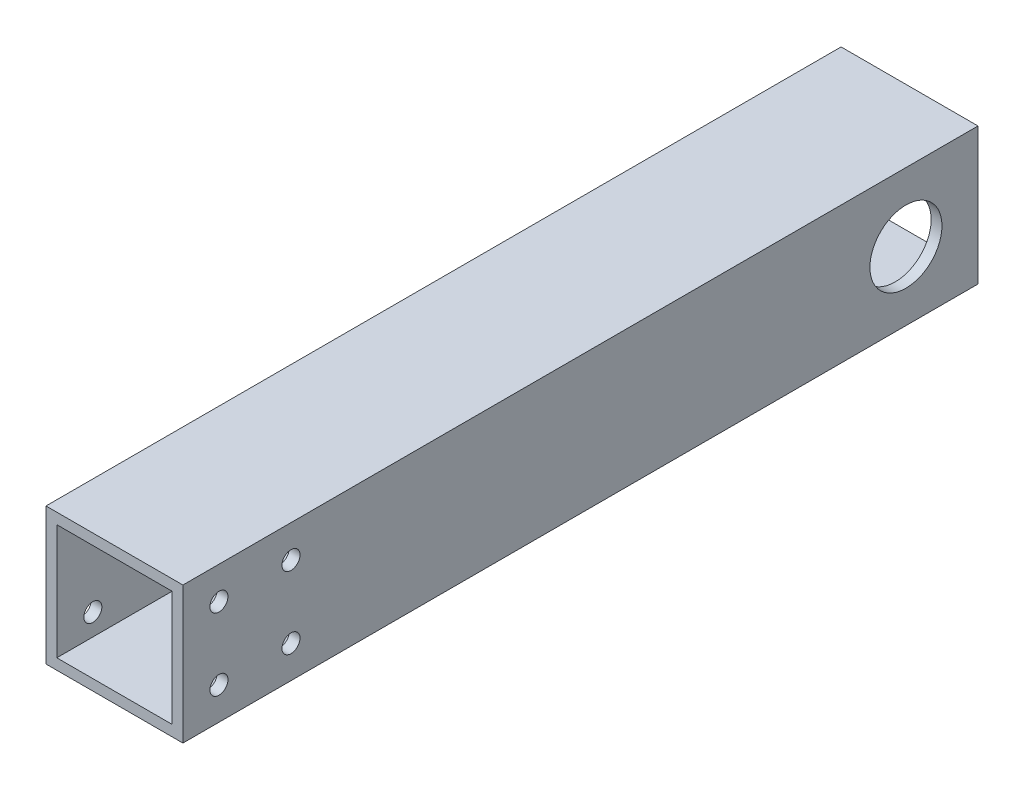
ISO-10303-21;
HEADER;
FILE_DESCRIPTION(('STEP AP214'),'2;1');
FILE_NAME('part.step','',(''),(''),'','','');
FILE_SCHEMA(('AUTOMOTIVE_DESIGN { 1 0 10303 214 1 1 1 1 }'));
ENDSEC;
DATA;
#1=APPLICATION_CONTEXT('core data for automotive mechanical design processes');
#2=APPLICATION_PROTOCOL_DEFINITION('international standard','automotive_design',2000,#1);
#3=PRODUCT_CONTEXT('',#1,'mechanical');
#4=PRODUCT('Part','Part','',(#3));
#5=PRODUCT_RELATED_PRODUCT_CATEGORY('part','',(#4));
#6=PRODUCT_DEFINITION_FORMATION('','',#4);
#7=PRODUCT_DEFINITION_CONTEXT('part definition',#1,'design');
#8=PRODUCT_DEFINITION('design','',#6,#7);
#9=PRODUCT_DEFINITION_SHAPE('','',#8);
#10=(LENGTH_UNIT() NAMED_UNIT(*) SI_UNIT(.MILLI.,.METRE.));
#11=(NAMED_UNIT(*) PLANE_ANGLE_UNIT() SI_UNIT($,.RADIAN.));
#12=(NAMED_UNIT(*) SI_UNIT($,.STERADIAN.) SOLID_ANGLE_UNIT());
#13=UNCERTAINTY_MEASURE_WITH_UNIT(LENGTH_MEASURE(1.E-05),#10,'distance_accuracy_value','');
#14=(GEOMETRIC_REPRESENTATION_CONTEXT(3) GLOBAL_UNCERTAINTY_ASSIGNED_CONTEXT((#13)) GLOBAL_UNIT_ASSIGNED_CONTEXT((#10,
#11,#12)) REPRESENTATION_CONTEXT('',''));
#15=CARTESIAN_POINT('',(0.,0.,0.));
#16=DIRECTION('',(0.,0.,1.));
#17=DIRECTION('',(1.,0.,0.));
#18=AXIS2_PLACEMENT_3D('',#15,#16,#17);
#19=CARTESIAN_POINT('',(0.,0.,220.68));
#20=DIRECTION('',(0.,0.,1.));
#21=DIRECTION('',(1.,0.,0.));
#22=AXIS2_PLACEMENT_3D('',#19,#20,#21);
#23=PLANE('',#22);
#24=DIRECTION('',(0.,-1.,0.));
#25=VECTOR('',#24,1.);
#26=CARTESIAN_POINT('',(-19.,-19.,220.68));
#27=LINE('',#26,#25);
#28=CARTESIAN_POINT('',(-19.,19.,220.68));
#29=VERTEX_POINT('',#28);
#30=CARTESIAN_POINT('',(-19.,-19.,220.68));
#31=VERTEX_POINT('',#30);
#32=EDGE_CURVE('E148',#29,#31,#27,.T.);
#33=ORIENTED_EDGE('',*,*,#32,.T.);
#34=DIRECTION('',(1.,0.,0.));
#35=VECTOR('',#34,1.);
#36=CARTESIAN_POINT('',(19.,-19.,220.68));
#37=LINE('',#36,#35);
#38=CARTESIAN_POINT('',(19.,-19.,220.68));
#39=VERTEX_POINT('',#38);
#40=EDGE_CURVE('E151',#31,#39,#37,.T.);
#41=ORIENTED_EDGE('',*,*,#40,.T.);
#42=DIRECTION('',(0.,1.,0.));
#43=VECTOR('',#42,1.);
#44=CARTESIAN_POINT('',(19.,-19.,220.68));
#45=LINE('',#44,#43);
#46=CARTESIAN_POINT('',(19.,19.,220.68));
#47=VERTEX_POINT('',#46);
#48=EDGE_CURVE('E154',#39,#47,#45,.T.);
#49=ORIENTED_EDGE('',*,*,#48,.T.);
#50=DIRECTION('',(-1.,0.,0.));
#51=VECTOR('',#50,1.);
#52=CARTESIAN_POINT('',(19.,19.,220.68));
#53=LINE('',#52,#51);
#54=EDGE_CURVE('E156',#47,#29,#53,.T.);
#55=ORIENTED_EDGE('',*,*,#54,.T.);
#56=EDGE_LOOP('',(#33,#41,#49,#55));
#57=FACE_BOUND('',#56,.T.);
#58=DIRECTION('',(-1.,0.,0.));
#59=VECTOR('',#58,1.);
#60=CARTESIAN_POINT('',(16.,16.,220.68));
#61=LINE('',#60,#59);
#62=CARTESIAN_POINT('',(16.,16.,220.68));
#63=VERTEX_POINT('',#62);
#64=CARTESIAN_POINT('',(-16.,16.,220.68));
#65=VERTEX_POINT('',#64);
#66=EDGE_CURVE('E118',#63,#65,#61,.T.);
#67=ORIENTED_EDGE('',*,*,#66,.F.);
#68=DIRECTION('',(0.,1.,0.));
#69=VECTOR('',#68,1.);
#70=CARTESIAN_POINT('',(16.,-16.,220.68));
#71=LINE('',#70,#69);
#72=CARTESIAN_POINT('',(16.,-16.,220.68));
#73=VERTEX_POINT('',#72);
#74=EDGE_CURVE('E110',#73,#63,#71,.T.);
#75=ORIENTED_EDGE('',*,*,#74,.F.);
#76=DIRECTION('',(1.,0.,0.));
#77=VECTOR('',#76,1.);
#78=CARTESIAN_POINT('',(16.,-16.,220.68));
#79=LINE('',#78,#77);
#80=CARTESIAN_POINT('',(-16.,-16.,220.68));
#81=VERTEX_POINT('',#80);
#82=EDGE_CURVE('E132',#81,#73,#79,.T.);
#83=ORIENTED_EDGE('',*,*,#82,.F.);
#84=DIRECTION('',(0.,-1.,0.));
#85=VECTOR('',#84,1.);
#86=CARTESIAN_POINT('',(-16.,-16.,220.68));
#87=LINE('',#86,#85);
#88=EDGE_CURVE('E130',#65,#81,#87,.T.);
#89=ORIENTED_EDGE('',*,*,#88,.F.);
#90=EDGE_LOOP('',(#67,#75,#83,#89));
#91=FACE_BOUND('',#90,.T.);
#92=ADVANCED_FACE('F43',(#57,#91),#23,.T.);
#93=CARTESIAN_POINT('',(0.,0.,0.));
#94=DIRECTION('',(0.,0.,1.));
#95=DIRECTION('',(1.,0.,0.));
#96=AXIS2_PLACEMENT_3D('',#93,#94,#95);
#97=PLANE('',#96);
#98=DIRECTION('',(0.,-1.,0.));
#99=VECTOR('',#98,1.);
#100=CARTESIAN_POINT('',(-19.,-19.,0.));
#101=LINE('',#100,#99);
#102=CARTESIAN_POINT('',(-19.,19.,0.));
#103=VERTEX_POINT('',#102);
#104=CARTESIAN_POINT('',(-19.,-19.,0.));
#105=VERTEX_POINT('',#104);
#106=EDGE_CURVE('E126',#103,#105,#101,.T.);
#107=ORIENTED_EDGE('',*,*,#106,.F.);
#108=DIRECTION('',(-1.,0.,0.));
#109=VECTOR('',#108,1.);
#110=CARTESIAN_POINT('',(19.,19.,0.));
#111=LINE('',#110,#109);
#112=CARTESIAN_POINT('',(19.,19.,0.));
#113=VERTEX_POINT('',#112);
#114=EDGE_CURVE('E152',#113,#103,#111,.T.);
#115=ORIENTED_EDGE('',*,*,#114,.F.);
#116=DIRECTION('',(0.,1.,0.));
#117=VECTOR('',#116,1.);
#118=CARTESIAN_POINT('',(19.,-19.,0.));
#119=LINE('',#118,#117);
#120=CARTESIAN_POINT('',(19.,-19.,0.));
#121=VERTEX_POINT('',#120);
#122=EDGE_CURVE('E163',#121,#113,#119,.T.);
#123=ORIENTED_EDGE('',*,*,#122,.F.);
#124=DIRECTION('',(1.,0.,0.));
#125=VECTOR('',#124,1.);
#126=CARTESIAN_POINT('',(19.,-19.,0.));
#127=LINE('',#126,#125);
#128=EDGE_CURVE('E161',#105,#121,#127,.T.);
#129=ORIENTED_EDGE('',*,*,#128,.F.);
#130=EDGE_LOOP('',(#107,#115,#123,#129));
#131=FACE_BOUND('',#130,.T.);
#132=DIRECTION('',(0.,1.,0.));
#133=VECTOR('',#132,1.);
#134=CARTESIAN_POINT('',(16.,-16.,0.));
#135=LINE('',#134,#133);
#136=CARTESIAN_POINT('',(16.,-16.,0.));
#137=VERTEX_POINT('',#136);
#138=CARTESIAN_POINT('',(16.,16.,0.));
#139=VERTEX_POINT('',#138);
#140=EDGE_CURVE('E68',#137,#139,#135,.T.);
#141=ORIENTED_EDGE('',*,*,#140,.T.);
#142=DIRECTION('',(-1.,0.,0.));
#143=VECTOR('',#142,1.);
#144=CARTESIAN_POINT('',(16.,16.,0.));
#145=LINE('',#144,#143);
#146=CARTESIAN_POINT('',(-16.,16.,0.));
#147=VERTEX_POINT('',#146);
#148=EDGE_CURVE('E125',#139,#147,#145,.T.);
#149=ORIENTED_EDGE('',*,*,#148,.T.);
#150=DIRECTION('',(0.,-1.,0.));
#151=VECTOR('',#150,1.);
#152=CARTESIAN_POINT('',(-16.,-16.,0.));
#153=LINE('',#152,#151);
#154=CARTESIAN_POINT('',(-16.,-16.,0.));
#155=VERTEX_POINT('',#154);
#156=EDGE_CURVE('E140',#147,#155,#153,.T.);
#157=ORIENTED_EDGE('',*,*,#156,.T.);
#158=DIRECTION('',(1.,0.,0.));
#159=VECTOR('',#158,1.);
#160=CARTESIAN_POINT('',(16.,-16.,0.));
#161=LINE('',#160,#159);
#162=EDGE_CURVE('E119',#155,#137,#161,.T.);
#163=ORIENTED_EDGE('',*,*,#162,.T.);
#164=EDGE_LOOP('',(#141,#149,#157,#163));
#165=FACE_BOUND('',#164,.T.);
#166=ADVANCED_FACE('F230',(#131,#165),#97,.F.);
#167=CARTESIAN_POINT('',(-19.,-19.,220.68));
#168=DIRECTION('',(1.,0.,0.));
#169=DIRECTION('',(0.,0.,-1.));
#170=AXIS2_PLACEMENT_3D('',#167,#168,#169);
#171=PLANE('',#170);
#172=CARTESIAN_POINT('',(-19.,0.,20.));
#173=DIRECTION('',(1.,0.,0.));
#174=DIRECTION('',(0.,0.,-1.));
#175=AXIS2_PLACEMENT_3D('',#172,#173,#174);
#176=CIRCLE('',#175,10.);
#177=CARTESIAN_POINT('',(-19.,0.,10.));
#178=VERTEX_POINT('',#177);
#179=EDGE_CURVE('E311',#178,#178,#176,.T.);
#180=ORIENTED_EDGE('',*,*,#179,.T.);
#181=EDGE_LOOP('',(#180));
#182=FACE_BOUND('',#181,.T.);
#183=CARTESIAN_POINT('',(-19.,-10.,210.68));
#184=DIRECTION('',(1.,0.,0.));
#185=DIRECTION('',(0.,0.,-1.));
#186=AXIS2_PLACEMENT_3D('',#183,#184,#185);
#187=CIRCLE('',#186,2.49999999999997);
#188=CARTESIAN_POINT('',(-19.,-10.,208.18));
#189=VERTEX_POINT('',#188);
#190=EDGE_CURVE('E194',#189,#189,#187,.T.);
#191=ORIENTED_EDGE('',*,*,#190,.T.);
#192=EDGE_LOOP('',(#191));
#193=FACE_BOUND('',#192,.T.);
#194=CARTESIAN_POINT('',(-19.,10.,190.68));
#195=DIRECTION('',(1.,0.,0.));
#196=DIRECTION('',(0.,0.,-1.));
#197=AXIS2_PLACEMENT_3D('',#194,#195,#196);
#198=CIRCLE('',#197,2.50000000000002);
#199=CARTESIAN_POINT('',(-19.,10.,188.18));
#200=VERTEX_POINT('',#199);
#201=EDGE_CURVE('E190',#200,#200,#198,.T.);
#202=ORIENTED_EDGE('',*,*,#201,.T.);
#203=EDGE_LOOP('',(#202));
#204=FACE_BOUND('',#203,.T.);
#205=CARTESIAN_POINT('',(-19.,10.,210.68));
#206=DIRECTION('',(1.,0.,0.));
#207=DIRECTION('',(0.,0.,-1.));
#208=AXIS2_PLACEMENT_3D('',#205,#206,#207);
#209=CIRCLE('',#208,2.49999999999997);
#210=CARTESIAN_POINT('',(-19.,10.,208.18));
#211=VERTEX_POINT('',#210);
#212=EDGE_CURVE('E186',#211,#211,#209,.T.);
#213=ORIENTED_EDGE('',*,*,#212,.T.);
#214=EDGE_LOOP('',(#213));
#215=FACE_BOUND('',#214,.T.);
#216=CARTESIAN_POINT('',(-19.,-10.,190.68));
#217=DIRECTION('',(1.,0.,0.));
#218=DIRECTION('',(0.,0.,-1.));
#219=AXIS2_PLACEMENT_3D('',#216,#217,#218);
#220=CIRCLE('',#219,2.50000000000002);
#221=CARTESIAN_POINT('',(-19.,-10.,188.18));
#222=VERTEX_POINT('',#221);
#223=EDGE_CURVE('E138',#222,#222,#220,.T.);
#224=ORIENTED_EDGE('',*,*,#223,.T.);
#225=EDGE_LOOP('',(#224));
#226=FACE_BOUND('',#225,.T.);
#227=ORIENTED_EDGE('',*,*,#106,.T.);
#228=DIRECTION('',(0.,0.,-1.));
#229=VECTOR('',#228,1.);
#230=CARTESIAN_POINT('',(-19.,-19.,220.68));
#231=LINE('',#230,#229);
#232=EDGE_CURVE('E11',#31,#105,#231,.T.);
#233=ORIENTED_EDGE('',*,*,#232,.F.);
#234=ORIENTED_EDGE('',*,*,#32,.F.);
#235=DIRECTION('',(0.,0.,-1.));
#236=VECTOR('',#235,1.);
#237=CARTESIAN_POINT('',(-19.,19.,220.68));
#238=LINE('',#237,#236);
#239=EDGE_CURVE('E158',#29,#103,#238,.T.);
#240=ORIENTED_EDGE('',*,*,#239,.T.);
#241=EDGE_LOOP('',(#227,#233,#234,#240));
#242=FACE_BOUND('',#241,.T.);
#243=ADVANCED_FACE('F45',(#182,#193,#204,#215,#226,#242),#171,.F.);
#244=CARTESIAN_POINT('',(19.,-19.,220.68));
#245=DIRECTION('',(0.,1.,0.));
#246=DIRECTION('',(-1.,0.,0.));
#247=AXIS2_PLACEMENT_3D('',#244,#245,#246);
#248=PLANE('',#247);
#249=ORIENTED_EDGE('',*,*,#128,.T.);
#250=DIRECTION('',(0.,0.,-1.));
#251=VECTOR('',#250,1.);
#252=CARTESIAN_POINT('',(19.,-19.,220.68));
#253=LINE('',#252,#251);
#254=EDGE_CURVE('E52',#39,#121,#253,.T.);
#255=ORIENTED_EDGE('',*,*,#254,.F.);
#256=ORIENTED_EDGE('',*,*,#40,.F.);
#257=ORIENTED_EDGE('',*,*,#232,.T.);
#258=EDGE_LOOP('',(#249,#255,#256,#257));
#259=FACE_BOUND('',#258,.T.);
#260=ADVANCED_FACE('F247',(#259),#248,.F.);
#261=CARTESIAN_POINT('',(19.,-19.,220.68));
#262=DIRECTION('',(-1.,0.,0.));
#263=DIRECTION('',(0.,0.,1.));
#264=AXIS2_PLACEMENT_3D('',#261,#262,#263);
#265=PLANE('',#264);
#266=CARTESIAN_POINT('',(19.,0.,20.));
#267=DIRECTION('',(1.,0.,0.));
#268=DIRECTION('',(0.,0.,-1.));
#269=AXIS2_PLACEMENT_3D('',#266,#267,#268);
#270=CIRCLE('',#269,10.);
#271=CARTESIAN_POINT('',(19.,0.,10.));
#272=VERTEX_POINT('',#271);
#273=EDGE_CURVE('E308',#272,#272,#270,.T.);
#274=ORIENTED_EDGE('',*,*,#273,.F.);
#275=EDGE_LOOP('',(#274));
#276=FACE_BOUND('',#275,.T.);
#277=CARTESIAN_POINT('',(19.,-10.,210.68));
#278=DIRECTION('',(-1.,0.,0.));
#279=DIRECTION('',(0.,0.,-1.));
#280=AXIS2_PLACEMENT_3D('',#277,#278,#279);
#281=CIRCLE('',#280,2.49999999999997);
#282=CARTESIAN_POINT('',(19.,-10.,208.18));
#283=VERTEX_POINT('',#282);
#284=EDGE_CURVE('E182',#283,#283,#281,.T.);
#285=ORIENTED_EDGE('',*,*,#284,.T.);
#286=EDGE_LOOP('',(#285));
#287=FACE_BOUND('',#286,.T.);
#288=CARTESIAN_POINT('',(19.,10.,190.68));
#289=DIRECTION('',(-1.,0.,0.));
#290=DIRECTION('',(0.,0.,-1.));
#291=AXIS2_PLACEMENT_3D('',#288,#289,#290);
#292=CIRCLE('',#291,2.50000000000002);
#293=CARTESIAN_POINT('',(19.,10.,188.18));
#294=VERTEX_POINT('',#293);
#295=EDGE_CURVE('E300',#294,#294,#292,.T.);
#296=ORIENTED_EDGE('',*,*,#295,.T.);
#297=EDGE_LOOP('',(#296));
#298=FACE_BOUND('',#297,.T.);
#299=CARTESIAN_POINT('',(19.,10.,210.68));
#300=DIRECTION('',(-1.,0.,0.));
#301=DIRECTION('',(0.,0.,-1.));
#302=AXIS2_PLACEMENT_3D('',#299,#300,#301);
#303=CIRCLE('',#302,2.49999999999997);
#304=CARTESIAN_POINT('',(19.,10.,208.18));
#305=VERTEX_POINT('',#304);
#306=EDGE_CURVE('E297',#305,#305,#303,.T.);
#307=ORIENTED_EDGE('',*,*,#306,.T.);
#308=EDGE_LOOP('',(#307));
#309=FACE_BOUND('',#308,.T.);
#310=CARTESIAN_POINT('',(19.,-10.,190.68));
#311=DIRECTION('',(-1.,0.,0.));
#312=DIRECTION('',(0.,0.,-1.));
#313=AXIS2_PLACEMENT_3D('',#310,#311,#312);
#314=CIRCLE('',#313,2.50000000000002);
#315=CARTESIAN_POINT('',(19.,-10.,188.18));
#316=VERTEX_POINT('',#315);
#317=EDGE_CURVE('E177',#316,#316,#314,.T.);
#318=ORIENTED_EDGE('',*,*,#317,.T.);
#319=EDGE_LOOP('',(#318));
#320=FACE_BOUND('',#319,.T.);
#321=ORIENTED_EDGE('',*,*,#122,.T.);
#322=DIRECTION('',(0.,0.,-1.));
#323=VECTOR('',#322,1.);
#324=CARTESIAN_POINT('',(19.,19.,220.68));
#325=LINE('',#324,#323);
#326=EDGE_CURVE('E168',#47,#113,#325,.T.);
#327=ORIENTED_EDGE('',*,*,#326,.F.);
#328=ORIENTED_EDGE('',*,*,#48,.F.);
#329=ORIENTED_EDGE('',*,*,#254,.T.);
#330=EDGE_LOOP('',(#321,#327,#328,#329));
#331=FACE_BOUND('',#330,.T.);
#332=ADVANCED_FACE('F244',(#276,#287,#298,#309,#320,#331),#265,.F.);
#333=CARTESIAN_POINT('',(19.,19.,220.68));
#334=DIRECTION('',(0.,-1.,0.));
#335=DIRECTION('',(1.,0.,0.));
#336=AXIS2_PLACEMENT_3D('',#333,#334,#335);
#337=PLANE('',#336);
#338=ORIENTED_EDGE('',*,*,#114,.T.);
#339=ORIENTED_EDGE('',*,*,#239,.F.);
#340=ORIENTED_EDGE('',*,*,#54,.F.);
#341=ORIENTED_EDGE('',*,*,#326,.T.);
#342=EDGE_LOOP('',(#338,#339,#340,#341));
#343=FACE_BOUND('',#342,.T.);
#344=ADVANCED_FACE('F241',(#343),#337,.F.);
#345=CARTESIAN_POINT('',(16.,-16.,220.68));
#346=DIRECTION('',(-1.,0.,0.));
#347=DIRECTION('',(0.,0.,1.));
#348=AXIS2_PLACEMENT_3D('',#345,#346,#347);
#349=PLANE('',#348);
#350=CARTESIAN_POINT('',(16.,0.,20.));
#351=DIRECTION('',(-1.,0.,0.));
#352=DIRECTION('',(0.,0.,1.));
#353=AXIS2_PLACEMENT_3D('',#350,#351,#352);
#354=CIRCLE('',#353,10.);
#355=CARTESIAN_POINT('',(16.,0.,30.));
#356=VERTEX_POINT('',#355);
#357=EDGE_CURVE('E301',#356,#356,#354,.T.);
#358=ORIENTED_EDGE('',*,*,#357,.F.);
#359=EDGE_LOOP('',(#358));
#360=FACE_BOUND('',#359,.T.);
#361=CARTESIAN_POINT('',(16.,-10.,210.68));
#362=DIRECTION('',(-1.,0.,0.));
#363=DIRECTION('',(0.,0.,1.));
#364=AXIS2_PLACEMENT_3D('',#361,#362,#363);
#365=CIRCLE('',#364,2.49999999999997);
#366=CARTESIAN_POINT('',(16.,-10.,213.18));
#367=VERTEX_POINT('',#366);
#368=EDGE_CURVE('E189',#367,#367,#365,.T.);
#369=ORIENTED_EDGE('',*,*,#368,.F.);
#370=EDGE_LOOP('',(#369));
#371=FACE_BOUND('',#370,.T.);
#372=CARTESIAN_POINT('',(16.,10.,190.68));
#373=DIRECTION('',(-1.,0.,0.));
#374=DIRECTION('',(0.,0.,1.));
#375=AXIS2_PLACEMENT_3D('',#372,#373,#374);
#376=CIRCLE('',#375,2.50000000000002);
#377=CARTESIAN_POINT('',(16.,10.,193.18));
#378=VERTEX_POINT('',#377);
#379=EDGE_CURVE('E185',#378,#378,#376,.T.);
#380=ORIENTED_EDGE('',*,*,#379,.F.);
#381=EDGE_LOOP('',(#380));
#382=FACE_BOUND('',#381,.T.);
#383=CARTESIAN_POINT('',(16.,10.,210.68));
#384=DIRECTION('',(-1.,0.,0.));
#385=DIRECTION('',(0.,0.,1.));
#386=AXIS2_PLACEMENT_3D('',#383,#384,#385);
#387=CIRCLE('',#386,2.49999999999997);
#388=CARTESIAN_POINT('',(16.,10.,213.18));
#389=VERTEX_POINT('',#388);
#390=EDGE_CURVE('E181',#389,#389,#387,.T.);
#391=ORIENTED_EDGE('',*,*,#390,.F.);
#392=EDGE_LOOP('',(#391));
#393=FACE_BOUND('',#392,.T.);
#394=CARTESIAN_POINT('',(16.,-10.,190.68));
#395=DIRECTION('',(-1.,0.,0.));
#396=DIRECTION('',(0.,0.,1.));
#397=AXIS2_PLACEMENT_3D('',#394,#395,#396);
#398=CIRCLE('',#397,2.50000000000002);
#399=CARTESIAN_POINT('',(16.,-10.,193.18));
#400=VERTEX_POINT('',#399);
#401=EDGE_CURVE('E176',#400,#400,#398,.T.);
#402=ORIENTED_EDGE('',*,*,#401,.F.);
#403=EDGE_LOOP('',(#402));
#404=FACE_BOUND('',#403,.T.);
#405=ORIENTED_EDGE('',*,*,#140,.F.);
#406=DIRECTION('',(0.,0.,-1.));
#407=VECTOR('',#406,1.);
#408=CARTESIAN_POINT('',(16.,-16.,220.68));
#409=LINE('',#408,#407);
#410=EDGE_CURVE('E114',#73,#137,#409,.T.);
#411=ORIENTED_EDGE('',*,*,#410,.F.);
#412=ORIENTED_EDGE('',*,*,#74,.T.);
#413=DIRECTION('',(0.,0.,-1.));
#414=VECTOR('',#413,1.);
#415=CARTESIAN_POINT('',(16.,16.,220.68));
#416=LINE('',#415,#414);
#417=EDGE_CURVE('E113',#63,#139,#416,.T.);
#418=ORIENTED_EDGE('',*,*,#417,.T.);
#419=EDGE_LOOP('',(#405,#411,#412,#418));
#420=FACE_BOUND('',#419,.T.);
#421=ADVANCED_FACE('F112',(#360,#371,#382,#393,#404,#420),#349,.T.);
#422=CARTESIAN_POINT('',(16.,16.,220.68));
#423=DIRECTION('',(0.,-1.,0.));
#424=DIRECTION('',(1.,0.,0.));
#425=AXIS2_PLACEMENT_3D('',#422,#423,#424);
#426=PLANE('',#425);
#427=ORIENTED_EDGE('',*,*,#148,.F.);
#428=ORIENTED_EDGE('',*,*,#417,.F.);
#429=ORIENTED_EDGE('',*,*,#66,.T.);
#430=DIRECTION('',(0.,0.,-1.));
#431=VECTOR('',#430,1.);
#432=CARTESIAN_POINT('',(-16.,16.,220.68));
#433=LINE('',#432,#431);
#434=EDGE_CURVE('E127',#65,#147,#433,.T.);
#435=ORIENTED_EDGE('',*,*,#434,.T.);
#436=EDGE_LOOP('',(#427,#428,#429,#435));
#437=FACE_BOUND('',#436,.T.);
#438=ADVANCED_FACE('F122',(#437),#426,.T.);
#439=CARTESIAN_POINT('',(-16.,-16.,220.68));
#440=DIRECTION('',(1.,0.,0.));
#441=DIRECTION('',(0.,1.,0.));
#442=AXIS2_PLACEMENT_3D('',#439,#440,#441);
#443=PLANE('',#442);
#444=CARTESIAN_POINT('',(-16.,0.,20.));
#445=DIRECTION('',(1.,0.,0.));
#446=DIRECTION('',(0.,1.,0.));
#447=AXIS2_PLACEMENT_3D('',#444,#445,#446);
#448=CIRCLE('',#447,10.);
#449=CARTESIAN_POINT('',(-16.,10.,20.));
#450=VERTEX_POINT('',#449);
#451=EDGE_CURVE('E47',#450,#450,#448,.T.);
#452=ORIENTED_EDGE('',*,*,#451,.F.);
#453=EDGE_LOOP('',(#452));
#454=FACE_BOUND('',#453,.T.);
#455=CARTESIAN_POINT('',(-16.,-10.,210.68));
#456=DIRECTION('',(1.,0.,0.));
#457=DIRECTION('',(0.,1.,0.));
#458=AXIS2_PLACEMENT_3D('',#455,#456,#457);
#459=CIRCLE('',#458,2.49999999999997);
#460=CARTESIAN_POINT('',(-16.,-7.50000000000003,210.68));
#461=VERTEX_POINT('',#460);
#462=EDGE_CURVE('E187',#461,#461,#459,.T.);
#463=ORIENTED_EDGE('',*,*,#462,.F.);
#464=EDGE_LOOP('',(#463));
#465=FACE_BOUND('',#464,.T.);
#466=CARTESIAN_POINT('',(-16.,10.,190.68));
#467=DIRECTION('',(1.,0.,0.));
#468=DIRECTION('',(0.,1.,0.));
#469=AXIS2_PLACEMENT_3D('',#466,#467,#468);
#470=CIRCLE('',#469,2.50000000000002);
#471=CARTESIAN_POINT('',(-16.,12.5,190.68));
#472=VERTEX_POINT('',#471);
#473=EDGE_CURVE('E183',#472,#472,#470,.T.);
#474=ORIENTED_EDGE('',*,*,#473,.F.);
#475=EDGE_LOOP('',(#474));
#476=FACE_BOUND('',#475,.T.);
#477=CARTESIAN_POINT('',(-16.,10.,210.68));
#478=DIRECTION('',(1.,0.,0.));
#479=DIRECTION('',(0.,1.,0.));
#480=AXIS2_PLACEMENT_3D('',#477,#478,#479);
#481=CIRCLE('',#480,2.49999999999997);
#482=CARTESIAN_POINT('',(-16.,12.5,210.68));
#483=VERTEX_POINT('',#482);
#484=EDGE_CURVE('E178',#483,#483,#481,.T.);
#485=ORIENTED_EDGE('',*,*,#484,.F.);
#486=EDGE_LOOP('',(#485));
#487=FACE_BOUND('',#486,.T.);
#488=CARTESIAN_POINT('',(-16.,-10.,190.68));
#489=DIRECTION('',(1.,0.,0.));
#490=DIRECTION('',(0.,1.,0.));
#491=AXIS2_PLACEMENT_3D('',#488,#489,#490);
#492=CIRCLE('',#491,2.50000000000002);
#493=CARTESIAN_POINT('',(-16.,-7.49999999999997,190.68));
#494=VERTEX_POINT('',#493);
#495=EDGE_CURVE('E173',#494,#494,#492,.T.);
#496=ORIENTED_EDGE('',*,*,#495,.F.);
#497=EDGE_LOOP('',(#496));
#498=FACE_BOUND('',#497,.T.);
#499=ORIENTED_EDGE('',*,*,#156,.F.);
#500=ORIENTED_EDGE('',*,*,#434,.F.);
#501=ORIENTED_EDGE('',*,*,#88,.T.);
#502=DIRECTION('',(0.,0.,-1.));
#503=VECTOR('',#502,1.);
#504=CARTESIAN_POINT('',(-16.,-16.,220.68));
#505=LINE('',#504,#503);
#506=EDGE_CURVE('E60',#81,#155,#505,.T.);
#507=ORIENTED_EDGE('',*,*,#506,.T.);
#508=EDGE_LOOP('',(#499,#500,#501,#507));
#509=FACE_BOUND('',#508,.T.);
#510=ADVANCED_FACE('F226',(#454,#465,#476,#487,#498,#509),#443,.T.);
#511=CARTESIAN_POINT('',(16.,-16.,220.68));
#512=DIRECTION('',(0.,1.,0.));
#513=DIRECTION('',(-1.,0.,0.));
#514=AXIS2_PLACEMENT_3D('',#511,#512,#513);
#515=PLANE('',#514);
#516=ORIENTED_EDGE('',*,*,#162,.F.);
#517=ORIENTED_EDGE('',*,*,#506,.F.);
#518=ORIENTED_EDGE('',*,*,#82,.T.);
#519=ORIENTED_EDGE('',*,*,#410,.T.);
#520=EDGE_LOOP('',(#516,#517,#518,#519));
#521=FACE_BOUND('',#520,.T.);
#522=ADVANCED_FACE('F217',(#521),#515,.T.);
#523=CARTESIAN_POINT('',(19.,-10.,190.68));
#524=DIRECTION('',(-1.,0.,0.));
#525=DIRECTION('',(0.,0.,1.));
#526=AXIS2_PLACEMENT_3D('',#523,#524,#525);
#527=CYLINDRICAL_SURFACE('',#526,2.50000000000002);
#528=ORIENTED_EDGE('',*,*,#495,.T.);
#529=EDGE_LOOP('',(#528));
#530=FACE_BOUND('',#529,.T.);
#531=ORIENTED_EDGE('',*,*,#223,.F.);
#532=EDGE_LOOP('',(#531));
#533=FACE_BOUND('',#532,.T.);
#534=ADVANCED_FACE('F214',(#530,#533),#527,.F.);
#535=ORIENTED_EDGE('',*,*,#401,.T.);
#536=EDGE_LOOP('',(#535));
#537=FACE_BOUND('',#536,.T.);
#538=ORIENTED_EDGE('',*,*,#317,.F.);
#539=EDGE_LOOP('',(#538));
#540=FACE_BOUND('',#539,.T.);
#541=ADVANCED_FACE('F216',(#537,#540),#527,.F.);
#542=CARTESIAN_POINT('',(19.,10.,210.68));
#543=DIRECTION('',(-1.,0.,0.));
#544=DIRECTION('',(0.,0.,1.));
#545=AXIS2_PLACEMENT_3D('',#542,#543,#544);
#546=CYLINDRICAL_SURFACE('',#545,2.49999999999997);
#547=ORIENTED_EDGE('',*,*,#484,.T.);
#548=EDGE_LOOP('',(#547));
#549=FACE_BOUND('',#548,.T.);
#550=ORIENTED_EDGE('',*,*,#212,.F.);
#551=EDGE_LOOP('',(#550));
#552=FACE_BOUND('',#551,.T.);
#553=ADVANCED_FACE('F224',(#549,#552),#546,.F.);
#554=CARTESIAN_POINT('',(19.,10.,190.68));
#555=DIRECTION('',(-1.,0.,0.));
#556=DIRECTION('',(0.,0.,1.));
#557=AXIS2_PLACEMENT_3D('',#554,#555,#556);
#558=CYLINDRICAL_SURFACE('',#557,2.50000000000002);
#559=ORIENTED_EDGE('',*,*,#473,.T.);
#560=EDGE_LOOP('',(#559));
#561=FACE_BOUND('',#560,.T.);
#562=ORIENTED_EDGE('',*,*,#201,.F.);
#563=EDGE_LOOP('',(#562));
#564=FACE_BOUND('',#563,.T.);
#565=ADVANCED_FACE('F289',(#561,#564),#558,.F.);
#566=CARTESIAN_POINT('',(19.,-10.,210.68));
#567=DIRECTION('',(-1.,0.,0.));
#568=DIRECTION('',(0.,0.,1.));
#569=AXIS2_PLACEMENT_3D('',#566,#567,#568);
#570=CYLINDRICAL_SURFACE('',#569,2.49999999999997);
#571=ORIENTED_EDGE('',*,*,#462,.T.);
#572=EDGE_LOOP('',(#571));
#573=FACE_BOUND('',#572,.T.);
#574=ORIENTED_EDGE('',*,*,#190,.F.);
#575=EDGE_LOOP('',(#574));
#576=FACE_BOUND('',#575,.T.);
#577=ADVANCED_FACE('F328',(#573,#576),#570,.F.);
#578=ORIENTED_EDGE('',*,*,#390,.T.);
#579=EDGE_LOOP('',(#578));
#580=FACE_BOUND('',#579,.T.);
#581=ORIENTED_EDGE('',*,*,#306,.F.);
#582=EDGE_LOOP('',(#581));
#583=FACE_BOUND('',#582,.T.);
#584=ADVANCED_FACE('F290',(#580,#583),#546,.F.);
#585=ORIENTED_EDGE('',*,*,#379,.T.);
#586=EDGE_LOOP('',(#585));
#587=FACE_BOUND('',#586,.T.);
#588=ORIENTED_EDGE('',*,*,#295,.F.);
#589=EDGE_LOOP('',(#588));
#590=FACE_BOUND('',#589,.T.);
#591=ADVANCED_FACE('F325',(#587,#590),#558,.F.);
#592=ORIENTED_EDGE('',*,*,#368,.T.);
#593=EDGE_LOOP('',(#592));
#594=FACE_BOUND('',#593,.T.);
#595=ORIENTED_EDGE('',*,*,#284,.F.);
#596=EDGE_LOOP('',(#595));
#597=FACE_BOUND('',#596,.T.);
#598=ADVANCED_FACE('F318',(#594,#597),#570,.F.);
#599=CARTESIAN_POINT('',(-19.,0.,20.));
#600=DIRECTION('',(1.,0.,0.));
#601=DIRECTION('',(0.,0.,-1.));
#602=AXIS2_PLACEMENT_3D('',#599,#600,#601);
#603=CYLINDRICAL_SURFACE('',#602,10.);
#604=ORIENTED_EDGE('',*,*,#451,.T.);
#605=EDGE_LOOP('',(#604));
#606=FACE_BOUND('',#605,.T.);
#607=ORIENTED_EDGE('',*,*,#179,.F.);
#608=EDGE_LOOP('',(#607));
#609=FACE_BOUND('',#608,.T.);
#610=ADVANCED_FACE('F315',(#606,#609),#603,.F.);
#611=ORIENTED_EDGE('',*,*,#357,.T.);
#612=EDGE_LOOP('',(#611));
#613=FACE_BOUND('',#612,.T.);
#614=ORIENTED_EDGE('',*,*,#273,.T.);
#615=EDGE_LOOP('',(#614));
#616=FACE_BOUND('',#615,.T.);
#617=ADVANCED_FACE('F317',(#613,#616),#603,.F.);
#618=CLOSED_SHELL('',(#92,#166,#243,#260,#332,#344,#421,#438,#510,#522,#534,#541,#553,#565,#577,
#584,#591,#598,#610,#617));
#619=MANIFOLD_SOLID_BREP('B2',#618);
#620=ADVANCED_BREP_SHAPE_REPRESENTATION('',(#18,#619),#14);
#621=SHAPE_DEFINITION_REPRESENTATION(#9,#620);
ENDSEC;
END-ISO-10303-21;
